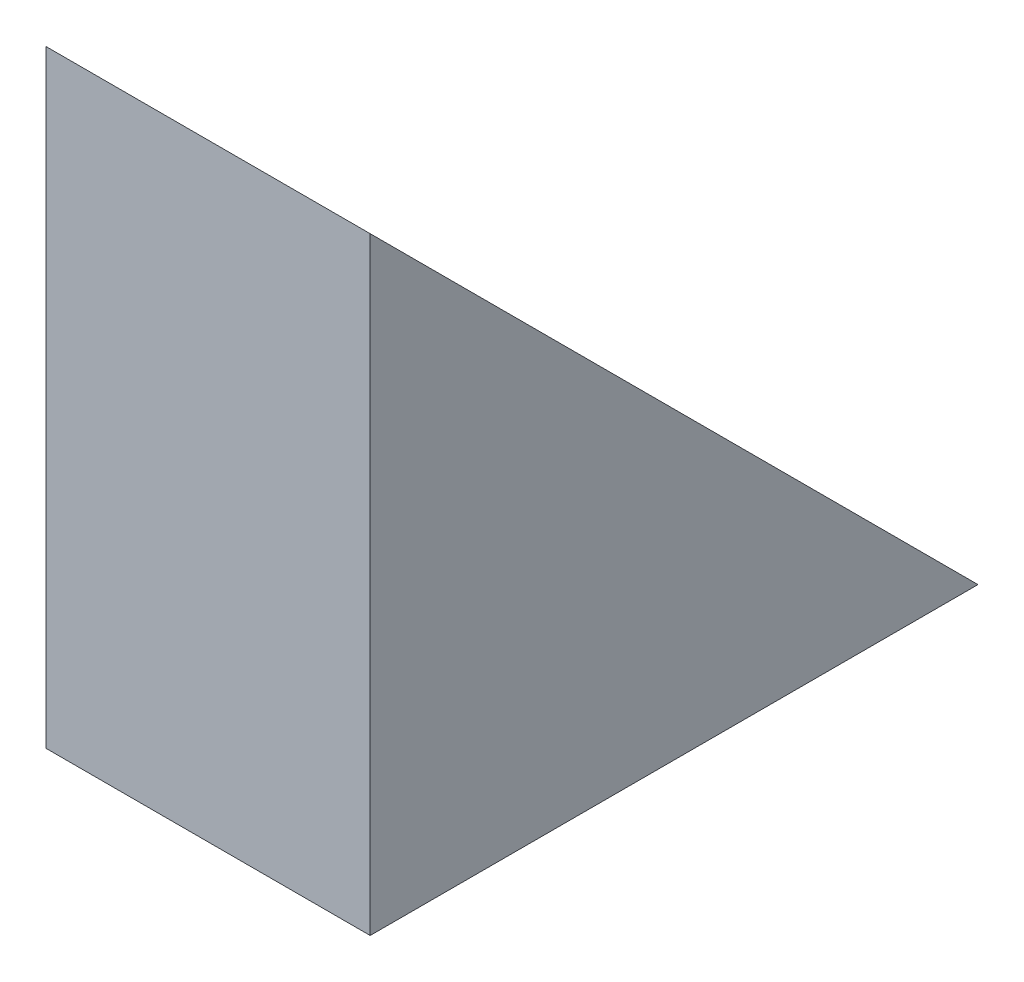
ISO-10303-21;
HEADER;
FILE_DESCRIPTION(('STEP AP214'),'2;1');
FILE_NAME('part.step','',(''),(''),'','','');
FILE_SCHEMA(('AUTOMOTIVE_DESIGN { 1 0 10303 214 1 1 1 1 }'));
ENDSEC;
DATA;
#1=APPLICATION_CONTEXT('core data for automotive mechanical design processes');
#2=APPLICATION_PROTOCOL_DEFINITION('international standard','automotive_design',2000,#1);
#3=PRODUCT_CONTEXT('',#1,'mechanical');
#4=PRODUCT('Part','Part','',(#3));
#5=PRODUCT_RELATED_PRODUCT_CATEGORY('part','',(#4));
#6=PRODUCT_DEFINITION_FORMATION('','',#4);
#7=PRODUCT_DEFINITION_CONTEXT('part definition',#1,'design');
#8=PRODUCT_DEFINITION('design','',#6,#7);
#9=PRODUCT_DEFINITION_SHAPE('','',#8);
#10=(LENGTH_UNIT() NAMED_UNIT(*) SI_UNIT(.MILLI.,.METRE.));
#11=(NAMED_UNIT(*) PLANE_ANGLE_UNIT() SI_UNIT($,.RADIAN.));
#12=(NAMED_UNIT(*) SI_UNIT($,.STERADIAN.) SOLID_ANGLE_UNIT());
#13=UNCERTAINTY_MEASURE_WITH_UNIT(LENGTH_MEASURE(1.E-05),#10,'distance_accuracy_value','');
#14=(GEOMETRIC_REPRESENTATION_CONTEXT(3) GLOBAL_UNCERTAINTY_ASSIGNED_CONTEXT((#13)) GLOBAL_UNIT_ASSIGNED_CONTEXT((#10,
#11,#12)) REPRESENTATION_CONTEXT('',''));
#15=CARTESIAN_POINT('',(0.,0.,0.));
#16=DIRECTION('',(0.,0.,1.));
#17=DIRECTION('',(1.,0.,0.));
#18=AXIS2_PLACEMENT_3D('',#15,#16,#17);
#19=CARTESIAN_POINT('',(-80.,0.,-150.));
#20=DIRECTION('',(0.,0.707106781186548,-0.707106781186548));
#21=DIRECTION('',(0.,0.707106781186548,0.707106781186548));
#22=AXIS2_PLACEMENT_3D('',#19,#20,#21);
#23=PLANE('',#22);
#24=DIRECTION('',(0.,0.707106781186548,0.707106781186548));
#25=VECTOR('',#24,1.);
#26=CARTESIAN_POINT('',(0.,0.,-150.));
#27=LINE('',#26,#25);
#28=CARTESIAN_POINT('',(0.,0.,-150.));
#29=VERTEX_POINT('',#28);
#30=CARTESIAN_POINT('',(0.,150.,0.));
#31=VERTEX_POINT('',#30);
#32=EDGE_CURVE('E85',#29,#31,#27,.T.);
#33=ORIENTED_EDGE('',*,*,#32,.F.);
#34=DIRECTION('',(1.,0.,0.));
#35=VECTOR('',#34,1.);
#36=CARTESIAN_POINT('',(-80.,0.,-150.));
#37=LINE('',#36,#35);
#38=CARTESIAN_POINT('',(-80.,0.,-150.));
#39=VERTEX_POINT('',#38);
#40=EDGE_CURVE('E11',#39,#29,#37,.T.);
#41=ORIENTED_EDGE('',*,*,#40,.F.);
#42=DIRECTION('',(0.,0.707106781186548,0.707106781186548));
#43=VECTOR('',#42,1.);
#44=CARTESIAN_POINT('',(-80.,0.,-150.));
#45=LINE('',#44,#43);
#46=CARTESIAN_POINT('',(-80.,150.,0.));
#47=VERTEX_POINT('',#46);
#48=EDGE_CURVE('E77',#39,#47,#45,.T.);
#49=ORIENTED_EDGE('',*,*,#48,.T.);
#50=DIRECTION('',(1.,0.,0.));
#51=VECTOR('',#50,1.);
#52=CARTESIAN_POINT('',(-80.,150.,0.));
#53=LINE('',#52,#51);
#54=EDGE_CURVE('E36',#47,#31,#53,.T.);
#55=ORIENTED_EDGE('',*,*,#54,.T.);
#56=EDGE_LOOP('',(#33,#41,#49,#55));
#57=FACE_BOUND('',#56,.T.);
#58=ADVANCED_FACE('F33',(#57),#23,.T.);
#59=CARTESIAN_POINT('',(-80.,0.,0.));
#60=DIRECTION('',(0.,-1.,0.));
#61=DIRECTION('',(0.,0.,-1.));
#62=AXIS2_PLACEMENT_3D('',#59,#60,#61);
#63=PLANE('',#62);
#64=DIRECTION('',(0.,0.,-1.));
#65=VECTOR('',#64,1.);
#66=CARTESIAN_POINT('',(0.,0.,0.));
#67=LINE('',#66,#65);
#68=CARTESIAN_POINT('',(0.,0.,0.));
#69=VERTEX_POINT('',#68);
#70=EDGE_CURVE('E79',#69,#29,#67,.T.);
#71=ORIENTED_EDGE('',*,*,#70,.F.);
#72=DIRECTION('',(1.,0.,0.));
#73=VECTOR('',#72,1.);
#74=CARTESIAN_POINT('',(-80.,0.,0.));
#75=LINE('',#74,#73);
#76=CARTESIAN_POINT('',(-80.,0.,0.));
#77=VERTEX_POINT('',#76);
#78=EDGE_CURVE('E42',#77,#69,#75,.T.);
#79=ORIENTED_EDGE('',*,*,#78,.F.);
#80=DIRECTION('',(0.,0.,-1.));
#81=VECTOR('',#80,1.);
#82=CARTESIAN_POINT('',(-80.,0.,0.));
#83=LINE('',#82,#81);
#84=EDGE_CURVE('E74',#77,#39,#83,.T.);
#85=ORIENTED_EDGE('',*,*,#84,.T.);
#86=ORIENTED_EDGE('',*,*,#40,.T.);
#87=EDGE_LOOP('',(#71,#79,#85,#86));
#88=FACE_BOUND('',#87,.T.);
#89=ADVANCED_FACE('F89',(#88),#63,.T.);
#90=CARTESIAN_POINT('',(-80.,150.,0.));
#91=DIRECTION('',(0.,0.,1.));
#92=DIRECTION('',(0.,-1.,0.));
#93=AXIS2_PLACEMENT_3D('',#90,#91,#92);
#94=PLANE('',#93);
#95=DIRECTION('',(0.,-1.,0.));
#96=VECTOR('',#95,1.);
#97=CARTESIAN_POINT('',(0.,150.,0.));
#98=LINE('',#97,#96);
#99=EDGE_CURVE('E72',#31,#69,#98,.T.);
#100=ORIENTED_EDGE('',*,*,#99,.F.);
#101=ORIENTED_EDGE('',*,*,#54,.F.);
#102=DIRECTION('',(0.,-1.,0.));
#103=VECTOR('',#102,1.);
#104=CARTESIAN_POINT('',(-80.,150.,0.));
#105=LINE('',#104,#103);
#106=EDGE_CURVE('E70',#47,#77,#105,.T.);
#107=ORIENTED_EDGE('',*,*,#106,.T.);
#108=ORIENTED_EDGE('',*,*,#78,.T.);
#109=EDGE_LOOP('',(#100,#101,#107,#108));
#110=FACE_BOUND('',#109,.T.);
#111=ADVANCED_FACE('F69',(#110),#94,.T.);
#112=CARTESIAN_POINT('',(-80.,0.,0.));
#113=DIRECTION('',(1.,0.,0.));
#114=DIRECTION('',(0.,0.,-1.));
#115=AXIS2_PLACEMENT_3D('',#112,#113,#114);
#116=PLANE('',#115);
#117=ORIENTED_EDGE('',*,*,#48,.F.);
#118=ORIENTED_EDGE('',*,*,#84,.F.);
#119=ORIENTED_EDGE('',*,*,#106,.F.);
#120=EDGE_LOOP('',(#117,#118,#119));
#121=FACE_BOUND('',#120,.T.);
#122=ADVANCED_FACE('F76',(#121),#116,.F.);
#123=CARTESIAN_POINT('',(0.,0.,0.));
#124=DIRECTION('',(1.,0.,0.));
#125=DIRECTION('',(0.,0.,-1.));
#126=AXIS2_PLACEMENT_3D('',#123,#124,#125);
#127=PLANE('',#126);
#128=ORIENTED_EDGE('',*,*,#32,.T.);
#129=ORIENTED_EDGE('',*,*,#99,.T.);
#130=ORIENTED_EDGE('',*,*,#70,.T.);
#131=EDGE_LOOP('',(#128,#129,#130));
#132=FACE_BOUND('',#131,.T.);
#133=ADVANCED_FACE('F88',(#132),#127,.T.);
#134=CLOSED_SHELL('',(#58,#89,#111,#122,#133));
#135=MANIFOLD_SOLID_BREP('B2',#134);
#136=ADVANCED_BREP_SHAPE_REPRESENTATION('',(#18,#135),#14);
#137=SHAPE_DEFINITION_REPRESENTATION(#9,#136);
ENDSEC;
END-ISO-10303-21;
